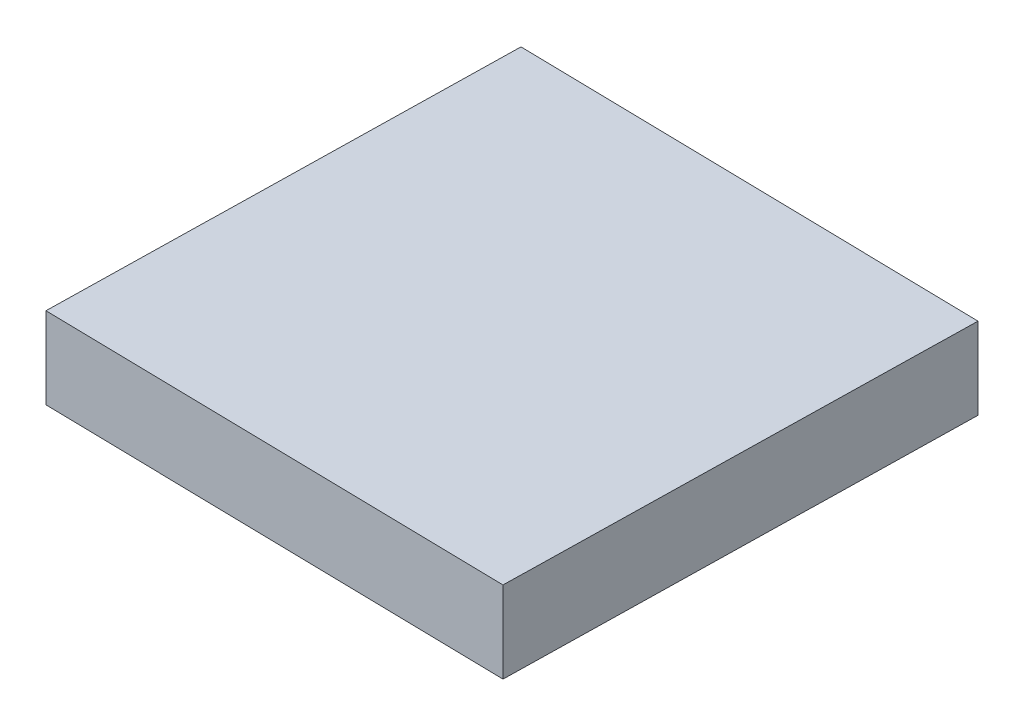
ISO-10303-21;
HEADER;
FILE_DESCRIPTION(('STEP AP214'),'2;1');
FILE_NAME('part.step','',(''),(''),'','','');
FILE_SCHEMA(('AUTOMOTIVE_DESIGN { 1 0 10303 214 1 1 1 1 }'));
ENDSEC;
DATA;
#1=APPLICATION_CONTEXT('core data for automotive mechanical design processes');
#2=APPLICATION_PROTOCOL_DEFINITION('international standard','automotive_design',2000,#1);
#3=PRODUCT_CONTEXT('',#1,'mechanical');
#4=PRODUCT('Part','Part','',(#3));
#5=PRODUCT_RELATED_PRODUCT_CATEGORY('part','',(#4));
#6=PRODUCT_DEFINITION_FORMATION('','',#4);
#7=PRODUCT_DEFINITION_CONTEXT('part definition',#1,'design');
#8=PRODUCT_DEFINITION('design','',#6,#7);
#9=PRODUCT_DEFINITION_SHAPE('','',#8);
#10=(LENGTH_UNIT() NAMED_UNIT(*) SI_UNIT(.MILLI.,.METRE.));
#11=(NAMED_UNIT(*) PLANE_ANGLE_UNIT() SI_UNIT($,.RADIAN.));
#12=(NAMED_UNIT(*) SI_UNIT($,.STERADIAN.) SOLID_ANGLE_UNIT());
#13=UNCERTAINTY_MEASURE_WITH_UNIT(LENGTH_MEASURE(1.E-05),#10,'distance_accuracy_value','');
#14=(GEOMETRIC_REPRESENTATION_CONTEXT(3) GLOBAL_UNCERTAINTY_ASSIGNED_CONTEXT((#13)) GLOBAL_UNIT_ASSIGNED_CONTEXT((#10,
#11,#12)) REPRESENTATION_CONTEXT('',''));
#15=CARTESIAN_POINT('',(0.,0.,0.));
#16=DIRECTION('',(0.,0.,1.));
#17=DIRECTION('',(1.,0.,0.));
#18=AXIS2_PLACEMENT_3D('',#15,#16,#17);
#19=CARTESIAN_POINT('',(-0.408407029951758,6.55860732929219,33.7608627921873));
#20=DIRECTION('',(0.,1.,0.));
#21=DIRECTION('',(1.,0.,0.));
#22=AXIS2_PLACEMENT_3D('',#19,#20,#21);
#23=PLANE('',#22);
#24=DIRECTION('',(0.999812677663925,0.,0.0193548335692299));
#25=VECTOR('',#24,1.);
#26=CARTESIAN_POINT('',(-2.89876995395228,6.55860732929223,31.1721773136551));
#27=LINE('',#26,#25);
#28=CARTESIAN_POINT('',(2.18027844858046,6.55860732929225,31.2704998681868));
#29=VERTEX_POINT('',#28);
#30=CARTESIAN_POINT('',(-2.89876995395228,6.55860732929212,31.1721773136551));
#31=VERTEX_POINT('',#30);
#32=EDGE_CURVE('E54',#29,#31,#27,.F.);
#33=ORIENTED_EDGE('',*,*,#32,.T.);
#34=DIRECTION('',(0.0193548335692301,0.,-0.999812677663925));
#35=VECTOR('',#34,1.);
#36=CARTESIAN_POINT('',(-2.99709250848397,6.55860732929207,36.2512257161878));
#37=LINE('',#36,#35);
#38=CARTESIAN_POINT('',(-2.99709250848397,6.55860732929212,36.2512257161878));
#39=VERTEX_POINT('',#38);
#40=EDGE_CURVE('E70',#31,#39,#37,.F.);
#41=ORIENTED_EDGE('',*,*,#40,.T.);
#42=DIRECTION('',(-0.999812677663925,0.,-0.0193548335692299));
#43=VECTOR('',#42,1.);
#44=CARTESIAN_POINT('',(-2.99709250848397,6.55860732929214,36.2512257161878));
#45=LINE('',#44,#43);
#46=CARTESIAN_POINT('',(2.08195589404876,6.55860732929226,36.3495482707195));
#47=VERTEX_POINT('',#46);
#48=EDGE_CURVE('E20',#39,#47,#45,.F.);
#49=ORIENTED_EDGE('',*,*,#48,.T.);
#50=DIRECTION('',(-0.0193548335692301,0.,0.999812677663925));
#51=VECTOR('',#50,1.);
#52=CARTESIAN_POINT('',(2.08195589404876,6.5586073292923,36.3495482707195));
#53=LINE('',#52,#51);
#54=EDGE_CURVE('E59',#47,#29,#53,.F.);
#55=ORIENTED_EDGE('',*,*,#54,.T.);
#56=EDGE_LOOP('',(#33,#41,#49,#55));
#57=FACE_BOUND('',#56,.T.);
#58=ADVANCED_FACE('F17',(#57),#23,.T.);
#59=CARTESIAN_POINT('',(-2.99709250848397,6.55860732929214,36.2512257161878));
#60=DIRECTION('',(0.0193548335692299,0.,-0.999812677663925));
#61=DIRECTION('',(-0.999812677663925,0.,-0.0193548335692299));
#62=AXIS2_PLACEMENT_3D('',#59,#60,#61);
#63=PLANE('',#62);
#64=DIRECTION('',(0.999812677663925,0.,0.0193548335692301));
#65=VECTOR('',#64,1.);
#66=CARTESIAN_POINT('',(-2.99709250848395,5.66960732929214,36.2512257161878));
#67=LINE('',#66,#65);
#68=CARTESIAN_POINT('',(-2.99709250848395,5.66960732929222,36.2512257161878));
#69=VERTEX_POINT('',#68);
#70=CARTESIAN_POINT('',(2.08195589404878,5.66960732929228,36.3495482707195));
#71=VERTEX_POINT('',#70);
#72=EDGE_CURVE('E77',#69,#71,#67,.T.);
#73=ORIENTED_EDGE('',*,*,#72,.T.);
#74=DIRECTION('',(0.,1.,0.));
#75=VECTOR('',#74,1.);
#76=CARTESIAN_POINT('',(2.08195589404876,6.5586073292923,36.3495482707195));
#77=LINE('',#76,#75);
#78=EDGE_CURVE('E64',#71,#47,#77,.T.);
#79=ORIENTED_EDGE('',*,*,#78,.T.);
#80=ORIENTED_EDGE('',*,*,#48,.F.);
#81=DIRECTION('',(0.,1.,0.));
#82=VECTOR('',#81,1.);
#83=CARTESIAN_POINT('',(-2.99709250848397,6.55860732929214,36.2512257161878));
#84=LINE('',#83,#82);
#85=EDGE_CURVE('E88',#39,#69,#84,.F.);
#86=ORIENTED_EDGE('',*,*,#85,.T.);
#87=EDGE_LOOP('',(#73,#79,#80,#86));
#88=FACE_BOUND('',#87,.T.);
#89=ADVANCED_FACE('F76',(#88),#63,.F.);
#90=CARTESIAN_POINT('',(2.08195589404876,6.5586073292923,36.3495482707195));
#91=DIRECTION('',(-0.999812677663925,0.,-0.0193548335692301));
#92=DIRECTION('',(-0.0193548335692301,0.,0.999812677663925));
#93=AXIS2_PLACEMENT_3D('',#90,#91,#92);
#94=PLANE('',#93);
#95=DIRECTION('',(0.0193548335692301,0.,-0.999812677663925));
#96=VECTOR('',#95,1.);
#97=CARTESIAN_POINT('',(2.08195589404879,5.6696073292923,36.3495482707195));
#98=LINE('',#97,#96);
#99=CARTESIAN_POINT('',(2.18027844858048,5.66960732929219,31.2704998681868));
#100=VERTEX_POINT('',#99);
#101=EDGE_CURVE('E95',#71,#100,#98,.T.);
#102=ORIENTED_EDGE('',*,*,#101,.T.);
#103=DIRECTION('',(0.,1.,0.));
#104=VECTOR('',#103,1.);
#105=CARTESIAN_POINT('',(2.18027844858048,6.55860732929207,31.2704998681868));
#106=LINE('',#105,#104);
#107=EDGE_CURVE('E66',#100,#29,#106,.T.);
#108=ORIENTED_EDGE('',*,*,#107,.T.);
#109=ORIENTED_EDGE('',*,*,#54,.F.);
#110=ORIENTED_EDGE('',*,*,#78,.F.);
#111=EDGE_LOOP('',(#102,#108,#109,#110));
#112=FACE_BOUND('',#111,.T.);
#113=ADVANCED_FACE('F62',(#112),#94,.F.);
#114=CARTESIAN_POINT('',(-2.89876995395228,6.55860732929207,31.1721773136551));
#115=DIRECTION('',(-0.0193548335692299,0.,0.999812677663925));
#116=DIRECTION('',(0.999812677663925,0.,0.0193548335692299));
#117=AXIS2_PLACEMENT_3D('',#114,#115,#116);
#118=PLANE('',#117);
#119=DIRECTION('',(-0.999812677663925,0.,-0.0193548335692302));
#120=VECTOR('',#119,1.);
#121=CARTESIAN_POINT('',(2.18027844858048,5.66960732929223,31.2704998681868));
#122=LINE('',#121,#120);
#123=CARTESIAN_POINT('',(-2.89876995395227,5.66960732929209,31.1721773136551));
#124=VERTEX_POINT('',#123);
#125=EDGE_CURVE('E27',#100,#124,#122,.T.);
#126=ORIENTED_EDGE('',*,*,#125,.T.);
#127=DIRECTION('',(0.,1.,0.));
#128=VECTOR('',#127,1.);
#129=CARTESIAN_POINT('',(-2.89876995395228,6.55860732929214,31.1721773136551));
#130=LINE('',#129,#128);
#131=EDGE_CURVE('E35',#124,#31,#130,.T.);
#132=ORIENTED_EDGE('',*,*,#131,.T.);
#133=ORIENTED_EDGE('',*,*,#32,.F.);
#134=ORIENTED_EDGE('',*,*,#107,.F.);
#135=EDGE_LOOP('',(#126,#132,#133,#134));
#136=FACE_BOUND('',#135,.T.);
#137=ADVANCED_FACE('F101',(#136),#118,.F.);
#138=CARTESIAN_POINT('',(-2.99709250848397,6.55860732929214,36.2512257161878));
#139=DIRECTION('',(0.999812677663925,0.,0.0193548335692301));
#140=DIRECTION('',(0.0193548335692301,0.,-0.999812677663925));
#141=AXIS2_PLACEMENT_3D('',#138,#139,#140);
#142=PLANE('',#141);
#143=DIRECTION('',(-0.01935483356923,0.,0.999812677663925));
#144=VECTOR('',#143,1.);
#145=CARTESIAN_POINT('',(-2.89876995395226,5.66960732929207,31.1721773136551));
#146=LINE('',#145,#144);
#147=EDGE_CURVE('E11',#124,#69,#146,.T.);
#148=ORIENTED_EDGE('',*,*,#147,.T.);
#149=ORIENTED_EDGE('',*,*,#85,.F.);
#150=ORIENTED_EDGE('',*,*,#40,.F.);
#151=ORIENTED_EDGE('',*,*,#131,.F.);
#152=EDGE_LOOP('',(#148,#149,#150,#151));
#153=FACE_BOUND('',#152,.T.);
#154=ADVANCED_FACE('F104',(#153),#142,.F.);
#155=CARTESIAN_POINT('',(-0.40840702995173,5.66960732929218,33.7608627921873));
#156=DIRECTION('',(0.,1.,0.));
#157=DIRECTION('',(1.,0.,0.));
#158=AXIS2_PLACEMENT_3D('',#155,#156,#157);
#159=PLANE('',#158);
#160=ORIENTED_EDGE('',*,*,#125,.F.);
#161=ORIENTED_EDGE('',*,*,#101,.F.);
#162=ORIENTED_EDGE('',*,*,#72,.F.);
#163=ORIENTED_EDGE('',*,*,#147,.F.);
#164=EDGE_LOOP('',(#160,#161,#162,#163));
#165=FACE_BOUND('',#164,.T.);
#166=ADVANCED_FACE('F103',(#165),#159,.F.);
#167=CLOSED_SHELL('',(#58,#89,#113,#137,#154,#166));
#168=MANIFOLD_SOLID_BREP('B1',#167);
#169=ADVANCED_BREP_SHAPE_REPRESENTATION('',(#18,#168),#14);
#170=SHAPE_DEFINITION_REPRESENTATION(#9,#169);
ENDSEC;
END-ISO-10303-21;
